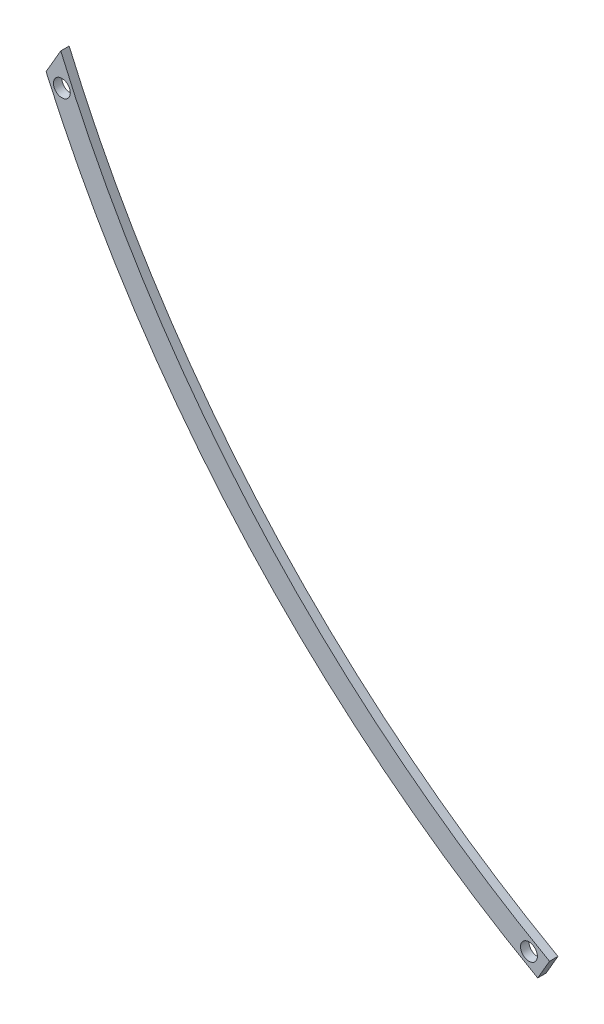
ISO-10303-21;
HEADER;
FILE_DESCRIPTION(('STEP AP214'),'2;1');
FILE_NAME('part.step','',(''),(''),'','','');
FILE_SCHEMA(('AUTOMOTIVE_DESIGN { 1 0 10303 214 1 1 1 1 }'));
ENDSEC;
DATA;
#1=APPLICATION_CONTEXT('core data for automotive mechanical design processes');
#2=APPLICATION_PROTOCOL_DEFINITION('international standard','automotive_design',2000,#1);
#3=PRODUCT_CONTEXT('',#1,'mechanical');
#4=PRODUCT('Part','Part','',(#3));
#5=PRODUCT_RELATED_PRODUCT_CATEGORY('part','',(#4));
#6=PRODUCT_DEFINITION_FORMATION('','',#4);
#7=PRODUCT_DEFINITION_CONTEXT('part definition',#1,'design');
#8=PRODUCT_DEFINITION('design','',#6,#7);
#9=PRODUCT_DEFINITION_SHAPE('','',#8);
#10=(LENGTH_UNIT() NAMED_UNIT(*) SI_UNIT(.MILLI.,.METRE.));
#11=(NAMED_UNIT(*) PLANE_ANGLE_UNIT() SI_UNIT($,.RADIAN.));
#12=(NAMED_UNIT(*) SI_UNIT($,.STERADIAN.) SOLID_ANGLE_UNIT());
#13=UNCERTAINTY_MEASURE_WITH_UNIT(LENGTH_MEASURE(1.E-05),#10,'distance_accuracy_value','');
#14=(GEOMETRIC_REPRESENTATION_CONTEXT(3) GLOBAL_UNCERTAINTY_ASSIGNED_CONTEXT((#13)) GLOBAL_UNIT_ASSIGNED_CONTEXT((#10,
#11,#12)) REPRESENTATION_CONTEXT('',''));
#15=CARTESIAN_POINT('',(0.,0.,0.));
#16=DIRECTION('',(0.,0.,1.));
#17=DIRECTION('',(1.,0.,0.));
#18=AXIS2_PLACEMENT_3D('',#15,#16,#17);
#19=CARTESIAN_POINT('',(3412.34924773845,5885.24743515971,50.));
#20=DIRECTION('',(0.,0.,-1.));
#21=DIRECTION('',(-1.,0.,0.));
#22=AXIS2_PLACEMENT_3D('',#19,#20,#21);
#23=PLANE('',#22);
#24=CARTESIAN_POINT('',(3412.34924773845,5885.24743515971,50.));
#25=DIRECTION('',(0.,0.,-1.));
#26=DIRECTION('',(-1.,0.,0.));
#27=AXIS2_PLACEMENT_3D('',#24,#25,#26);
#28=CIRCLE('',#27,6732.95999999964);
#29=CARTESIAN_POINT('',(121.994454448105,11.0397697918607,50.));
#30=VERTEX_POINT('',#29);
#31=CARTESIAN_POINT('',(-2779.46844110716,3240.60302244677,50.));
#32=VERTEX_POINT('',#31);
#33=EDGE_CURVE('E49',#30,#32,#28,.T.);
#34=ORIENTED_EDGE('',*,*,#33,.T.);
#35=DIRECTION('',(-0.501597723305544,-0.865100990621728,0.));
#36=VECTOR('',#35,1.);
#37=CARTESIAN_POINT('',(-2779.46844110716,3240.60302244677,50.));
#38=LINE('',#37,#36);
#39=CARTESIAN_POINT('',(-2866.63608223872,3090.26579165529,50.));
#40=VERTEX_POINT('',#39);
#41=EDGE_CURVE('E78',#32,#40,#38,.T.);
#42=ORIENTED_EDGE('',*,*,#41,.T.);
#43=CARTESIAN_POINT('',(3412.34924773845,5885.24743515971,50.));
#44=DIRECTION('',(0.,0.,1.));
#45=DIRECTION('',(-1.,0.,0.));
#46=AXIS2_PLACEMENT_3D('',#43,#44,#45);
#47=CIRCLE('',#46,6872.95999999965);
#48=CARTESIAN_POINT('',(51.7631843671055,-110.087457260338,50.));
#49=VERTEX_POINT('',#48);
#50=EDGE_CURVE('E82',#40,#49,#47,.T.);
#51=ORIENTED_EDGE('',*,*,#50,.T.);
#52=DIRECTION('',(0.501597723305545,0.865100990621728,0.));
#53=VECTOR('',#52,1.);
#54=CARTESIAN_POINT('',(51.7631843671055,-110.087457260338,50.));
#55=LINE('',#54,#53);
#56=EDGE_CURVE('E91',#49,#30,#55,.T.);
#57=ORIENTED_EDGE('',*,*,#56,.T.);
#58=EDGE_LOOP('',(#34,#42,#51,#57));
#59=FACE_BOUND('',#58,.T.);
#60=CARTESIAN_POINT('',(-2772.84973901146,3052.65529086794,50.));
#61=DIRECTION('',(0.,0.,1.));
#62=DIRECTION('',(1.,0.,0.));
#63=AXIS2_PLACEMENT_3D('',#60,#61,#62);
#64=CIRCLE('',#63,50.);
#65=CARTESIAN_POINT('',(-2722.84973901146,3052.65529086794,50.));
#66=VERTEX_POINT('',#65);
#67=EDGE_CURVE('E98',#66,#66,#64,.T.);
#68=ORIENTED_EDGE('',*,*,#67,.F.);
#69=EDGE_LOOP('',(#68));
#70=FACE_BOUND('',#69,.T.);
#71=CARTESIAN_POINT('',(0.,0.,50.));
#72=DIRECTION('',(0.,0.,1.));
#73=DIRECTION('',(1.,0.,0.));
#74=AXIS2_PLACEMENT_3D('',#71,#72,#73);
#75=CIRCLE('',#74,50.0000000000012);
#76=CARTESIAN_POINT('',(50.0000000000012,0.,50.));
#77=VERTEX_POINT('',#76);
#78=EDGE_CURVE('E136',#77,#77,#75,.T.);
#79=ORIENTED_EDGE('',*,*,#78,.F.);
#80=EDGE_LOOP('',(#79));
#81=FACE_BOUND('',#80,.T.);
#82=ADVANCED_FACE('F32',(#59,#70,#81),#23,.F.);
#83=CARTESIAN_POINT('',(3412.34924773845,5885.24743515971,0.));
#84=DIRECTION('',(0.,0.,-1.));
#85=DIRECTION('',(-1.,0.,0.));
#86=AXIS2_PLACEMENT_3D('',#83,#84,#85);
#87=PLANE('',#86);
#88=CARTESIAN_POINT('',(-2772.84973901146,3052.65529086794,0.));
#89=DIRECTION('',(0.,0.,1.));
#90=DIRECTION('',(1.,0.,0.));
#91=AXIS2_PLACEMENT_3D('',#88,#89,#90);
#92=CIRCLE('',#91,50.);
#93=CARTESIAN_POINT('',(-2722.84973901146,3052.65529086794,0.));
#94=VERTEX_POINT('',#93);
#95=EDGE_CURVE('E141',#94,#94,#92,.T.);
#96=ORIENTED_EDGE('',*,*,#95,.T.);
#97=EDGE_LOOP('',(#96));
#98=FACE_BOUND('',#97,.T.);
#99=DIRECTION('',(-0.501597723305544,-0.865100990621728,0.));
#100=VECTOR('',#99,1.);
#101=CARTESIAN_POINT('',(-2779.46844110716,3240.60302244677,0.));
#102=LINE('',#101,#100);
#103=CARTESIAN_POINT('',(-2779.46844110716,3240.60302244677,0.));
#104=VERTEX_POINT('',#103);
#105=CARTESIAN_POINT('',(-2866.63608223872,3090.26579165529,0.));
#106=VERTEX_POINT('',#105);
#107=EDGE_CURVE('E87',#104,#106,#102,.T.);
#108=ORIENTED_EDGE('',*,*,#107,.F.);
#109=CARTESIAN_POINT('',(3412.34924773851,5885.24743515972,0.));
#110=DIRECTION('',(0.,0.,-1.));
#111=DIRECTION('',(1.,0.,0.));
#112=AXIS2_PLACEMENT_3D('',#109,#110,#111);
#113=CIRCLE('',#112,6732.95999999968);
#114=CARTESIAN_POINT('',(121.994454448105,11.0397697918607,0.));
#115=VERTEX_POINT('',#114);
#116=EDGE_CURVE('E101',#115,#104,#113,.T.);
#117=ORIENTED_EDGE('',*,*,#116,.F.);
#118=DIRECTION('',(0.501597723305545,0.865100990621728,0.));
#119=VECTOR('',#118,1.);
#120=CARTESIAN_POINT('',(51.7631843671055,-110.087457260338,0.));
#121=LINE('',#120,#119);
#122=CARTESIAN_POINT('',(51.7631843671055,-110.087457260338,0.));
#123=VERTEX_POINT('',#122);
#124=EDGE_CURVE('E73',#123,#115,#121,.T.);
#125=ORIENTED_EDGE('',*,*,#124,.F.);
#126=CARTESIAN_POINT('',(3412.34924773851,5885.24743515972,0.));
#127=DIRECTION('',(0.,0.,1.));
#128=DIRECTION('',(1.,0.,0.));
#129=AXIS2_PLACEMENT_3D('',#126,#127,#128);
#130=CIRCLE('',#129,6872.95999999966);
#131=EDGE_CURVE('E66',#106,#123,#130,.T.);
#132=ORIENTED_EDGE('',*,*,#131,.F.);
#133=EDGE_LOOP('',(#108,#117,#125,#132));
#134=FACE_BOUND('',#133,.T.);
#135=CARTESIAN_POINT('',(0.,0.,0.));
#136=DIRECTION('',(0.,0.,1.));
#137=DIRECTION('',(1.,0.,0.));
#138=AXIS2_PLACEMENT_3D('',#135,#136,#137);
#139=CIRCLE('',#138,50.0000000000012);
#140=CARTESIAN_POINT('',(50.0000000000012,0.,0.));
#141=VERTEX_POINT('',#140);
#142=EDGE_CURVE('E139',#141,#141,#139,.T.);
#143=ORIENTED_EDGE('',*,*,#142,.T.);
#144=EDGE_LOOP('',(#143));
#145=FACE_BOUND('',#144,.T.);
#146=ADVANCED_FACE('F107',(#98,#134,#145),#87,.T.);
#147=CARTESIAN_POINT('',(-2779.46844110716,3240.60302244677,50.));
#148=DIRECTION('',(0.865100990621728,-0.501597723305544,0.));
#149=DIRECTION('',(0.501597723305544,0.865100990621728,0.));
#150=AXIS2_PLACEMENT_3D('',#147,#148,#149);
#151=PLANE('',#150);
#152=ORIENTED_EDGE('',*,*,#107,.T.);
#153=DIRECTION('',(0.,0.,-1.));
#154=VECTOR('',#153,1.);
#155=CARTESIAN_POINT('',(-2866.63608223872,3090.26579165529,50.));
#156=LINE('',#155,#154);
#157=EDGE_CURVE('E41',#40,#106,#156,.T.);
#158=ORIENTED_EDGE('',*,*,#157,.F.);
#159=ORIENTED_EDGE('',*,*,#41,.F.);
#160=DIRECTION('',(0.,0.,-1.));
#161=VECTOR('',#160,1.);
#162=CARTESIAN_POINT('',(-2779.46844110716,3240.60302244677,50.));
#163=LINE('',#162,#161);
#164=EDGE_CURVE('E11',#32,#104,#163,.T.);
#165=ORIENTED_EDGE('',*,*,#164,.T.);
#166=EDGE_LOOP('',(#152,#158,#159,#165));
#167=FACE_BOUND('',#166,.T.);
#168=ADVANCED_FACE('F34',(#167),#151,.F.);
#169=CARTESIAN_POINT('',(3412.34924773851,5885.24743515972,50.));
#170=DIRECTION('',(0.,0.,-1.));
#171=DIRECTION('',(-1.,0.,0.));
#172=AXIS2_PLACEMENT_3D('',#169,#170,#171);
#173=CYLINDRICAL_SURFACE('',#172,6872.95999999966);
#174=ORIENTED_EDGE('',*,*,#131,.T.);
#175=DIRECTION('',(0.,0.,-1.));
#176=VECTOR('',#175,1.);
#177=CARTESIAN_POINT('',(51.7631843671055,-110.087457260338,50.));
#178=LINE('',#177,#176);
#179=EDGE_CURVE('E88',#49,#123,#178,.T.);
#180=ORIENTED_EDGE('',*,*,#179,.F.);
#181=ORIENTED_EDGE('',*,*,#50,.F.);
#182=ORIENTED_EDGE('',*,*,#157,.T.);
#183=EDGE_LOOP('',(#174,#180,#181,#182));
#184=FACE_BOUND('',#183,.T.);
#185=ADVANCED_FACE('F89',(#184),#173,.T.);
#186=CARTESIAN_POINT('',(51.7631843671055,-110.087457260338,50.));
#187=DIRECTION('',(-0.865100990621728,0.501597723305545,0.));
#188=DIRECTION('',(-0.501597723305545,-0.865100990621728,0.));
#189=AXIS2_PLACEMENT_3D('',#186,#187,#188);
#190=PLANE('',#189);
#191=ORIENTED_EDGE('',*,*,#124,.T.);
#192=DIRECTION('',(0.,0.,-1.));
#193=VECTOR('',#192,1.);
#194=CARTESIAN_POINT('',(121.994454448105,11.0397697918607,50.));
#195=LINE('',#194,#193);
#196=EDGE_CURVE('E93',#30,#115,#195,.T.);
#197=ORIENTED_EDGE('',*,*,#196,.F.);
#198=ORIENTED_EDGE('',*,*,#56,.F.);
#199=ORIENTED_EDGE('',*,*,#179,.T.);
#200=EDGE_LOOP('',(#191,#197,#198,#199));
#201=FACE_BOUND('',#200,.T.);
#202=ADVANCED_FACE('F104',(#201),#190,.F.);
#203=CARTESIAN_POINT('',(3412.34924773851,5885.24743515972,50.));
#204=DIRECTION('',(0.,0.,-1.));
#205=DIRECTION('',(-1.,0.,0.));
#206=AXIS2_PLACEMENT_3D('',#203,#204,#205);
#207=CYLINDRICAL_SURFACE('',#206,6732.95999999968);
#208=ORIENTED_EDGE('',*,*,#116,.T.);
#209=ORIENTED_EDGE('',*,*,#164,.F.);
#210=ORIENTED_EDGE('',*,*,#33,.F.);
#211=ORIENTED_EDGE('',*,*,#196,.T.);
#212=EDGE_LOOP('',(#208,#209,#210,#211));
#213=FACE_BOUND('',#212,.T.);
#214=ADVANCED_FACE('F109',(#213),#207,.F.);
#215=CARTESIAN_POINT('',(-2772.84973901146,3052.65529086794,50.));
#216=DIRECTION('',(0.,0.,-1.));
#217=DIRECTION('',(-1.,0.,0.));
#218=AXIS2_PLACEMENT_3D('',#215,#216,#217);
#219=CYLINDRICAL_SURFACE('',#218,50.);
#220=ORIENTED_EDGE('',*,*,#67,.T.);
#221=EDGE_LOOP('',(#220));
#222=FACE_BOUND('',#221,.T.);
#223=ORIENTED_EDGE('',*,*,#95,.F.);
#224=EDGE_LOOP('',(#223));
#225=FACE_BOUND('',#224,.T.);
#226=ADVANCED_FACE('F111',(#222,#225),#219,.F.);
#227=CARTESIAN_POINT('',(0.,0.,50.));
#228=DIRECTION('',(0.,0.,-1.));
#229=DIRECTION('',(-1.,0.,0.));
#230=AXIS2_PLACEMENT_3D('',#227,#228,#229);
#231=CYLINDRICAL_SURFACE('',#230,50.0000000000012);
#232=ORIENTED_EDGE('',*,*,#78,.T.);
#233=EDGE_LOOP('',(#232));
#234=FACE_BOUND('',#233,.T.);
#235=ORIENTED_EDGE('',*,*,#142,.F.);
#236=EDGE_LOOP('',(#235));
#237=FACE_BOUND('',#236,.T.);
#238=ADVANCED_FACE('F117',(#234,#237),#231,.F.);
#239=CLOSED_SHELL('',(#82,#146,#168,#185,#202,#214,#226,#238));
#240=MANIFOLD_SOLID_BREP('B2',#239);
#241=ADVANCED_BREP_SHAPE_REPRESENTATION('',(#18,#240),#14);
#242=SHAPE_DEFINITION_REPRESENTATION(#9,#241);
ENDSEC;
END-ISO-10303-21;
